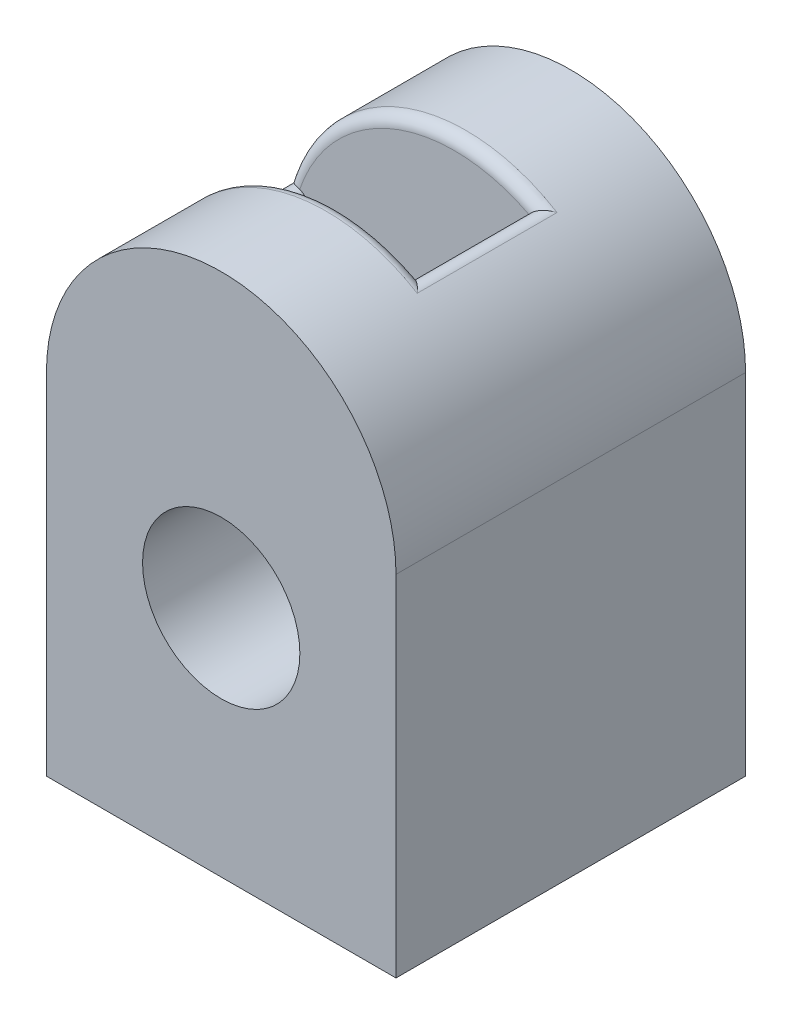
ISO-10303-21;
HEADER;
FILE_DESCRIPTION(('STEP AP214'),'2;1');
FILE_NAME('part.step','',(''),(''),'','','');
FILE_SCHEMA(('AUTOMOTIVE_DESIGN { 1 0 10303 214 1 1 1 1 }'));
ENDSEC;
DATA;
#1=APPLICATION_CONTEXT('core data for automotive mechanical design processes');
#2=APPLICATION_PROTOCOL_DEFINITION('international standard','automotive_design',2000,#1);
#3=PRODUCT_CONTEXT('',#1,'mechanical');
#4=PRODUCT('Part','Part','',(#3));
#5=PRODUCT_RELATED_PRODUCT_CATEGORY('part','',(#4));
#6=PRODUCT_DEFINITION_FORMATION('','',#4);
#7=PRODUCT_DEFINITION_CONTEXT('part definition',#1,'design');
#8=PRODUCT_DEFINITION('design','',#6,#7);
#9=PRODUCT_DEFINITION_SHAPE('','',#8);
#10=(LENGTH_UNIT() NAMED_UNIT(*) SI_UNIT(.MILLI.,.METRE.));
#11=(NAMED_UNIT(*) PLANE_ANGLE_UNIT() SI_UNIT($,.RADIAN.));
#12=(NAMED_UNIT(*) SI_UNIT($,.STERADIAN.) SOLID_ANGLE_UNIT());
#13=UNCERTAINTY_MEASURE_WITH_UNIT(LENGTH_MEASURE(1.E-05),#10,'distance_accuracy_value','');
#14=(GEOMETRIC_REPRESENTATION_CONTEXT(3) GLOBAL_UNCERTAINTY_ASSIGNED_CONTEXT((#13)) GLOBAL_UNIT_ASSIGNED_CONTEXT((#10,
#11,#12)) REPRESENTATION_CONTEXT('',''));
#15=CARTESIAN_POINT('',(0.,0.,0.));
#16=DIRECTION('',(0.,0.,1.));
#17=DIRECTION('',(1.,0.,0.));
#18=AXIS2_PLACEMENT_3D('',#15,#16,#17);
#19=CARTESIAN_POINT('',(-13.5522693622497,13.5122635341086,15.));
#20=DIRECTION('',(0.,0.,-1.));
#21=DIRECTION('',(-1.,0.,0.));
#22=AXIS2_PLACEMENT_3D('',#19,#20,#21);
#23=CYLINDRICAL_SURFACE('',#22,1.);
#24=CARTESIAN_POINT('',(-13.2669813282875,14.470705362118,-5.));
#25=CARTESIAN_POINT('',(-13.2886549354625,14.4771599167456,-4.99999697005028));
#26=CARTESIAN_POINT('',(-13.310535261551,14.482868500035,-5.00076675264369));
#27=CARTESIAN_POINT('',(-13.3545139344958,14.4927733665127,-5.00380524962965));
#28=CARTESIAN_POINT('',(-13.3766120810924,14.4969709259286,-5.006072694469));
#29=CARTESIAN_POINT('',(-13.4425790289543,14.5072162741307,-5.01499715030661));
#30=CARTESIAN_POINT('',(-13.4865354315754,14.5110386782043,-5.02377821691352));
#31=CARTESIAN_POINT('',(-13.5730866238791,14.5129839438399,-5.04626487565494));
#32=CARTESIAN_POINT('',(-13.615685124967,14.511123984371,-5.05995551457227));
#33=CARTESIAN_POINT('',(-13.6988671923582,14.5023460961429,-5.09143053413603));
#34=CARTESIAN_POINT('',(-13.7394458016846,14.495416321907,-5.10922443514525));
#35=CARTESIAN_POINT('',(-13.8338845789855,14.4734619662784,-5.15596338401785));
#36=CARTESIAN_POINT('',(-13.8864557144665,14.4562941085068,-5.18650397289579));
#37=CARTESIAN_POINT('',(-13.9856768012027,14.4150680381352,-5.252169021299));
#38=CARTESIAN_POINT('',(-14.0323161855177,14.3909977709159,-5.28730144123304));
#39=CARTESIAN_POINT('',(-14.1350318671314,14.3278634579868,-5.37387849632621));
#40=CARTESIAN_POINT('',(-14.1885560859107,14.2865122624385,-5.42667747027591));
#41=CARTESIAN_POINT('',(-14.2845377521119,14.1964581262902,-5.5358934012387));
#42=CARTESIAN_POINT('',(-14.3269807320591,14.1477457046304,-5.59231496936035));
#43=CARTESIAN_POINT('',(-14.4003008040791,14.0458438914801,-5.70614712182948));
#44=CARTESIAN_POINT('',(-14.4313782085426,13.9927545426096,-5.76351983091358));
#45=CARTESIAN_POINT('',(-14.4830777865351,13.8827716485123,-5.87909931601603));
#46=CARTESIAN_POINT('',(-14.5037226968683,13.8258866847549,-5.93730399143005));
#47=CARTESIAN_POINT('',(-14.5194975786207,13.766176973755,-5.99696764936091));
#48=CARTESIAN_POINT('',(-14.5198948833203,13.7646586760216,-5.99848384889321));
#49=CARTESIAN_POINT('',(-14.5202886024104,13.7631395008306,-6.));
#50=B_SPLINE_CURVE_WITH_KNOTS('',3,(#24,#25,#26,#27,#28,#29,#30,#31,#32,#33,#34,#35,#36,#37,#38,
#39,#40,#41,#42,#43,#44,#45,#46,#47,#48,#49),.UNSPECIFIED.,.F.,.F.,(4,2,2,2,2,2,2,2,2,2,2,2,4),
(0.,0.0677892638747012,0.135521137096123,0.269707441452711,0.403488474507335,0.537583085428256,
0.726069137009203,0.914886393459821,1.17092839575811,1.42730302910178,1.67891241974008,
1.92997105648405,1.93651760257399),.UNSPECIFIED.);
#51=CARTESIAN_POINT('',(-14.5202886024104,13.7631395008306,-6.));
#52=VERTEX_POINT('',#51);
#53=CARTESIAN_POINT('',(-13.2669813282875,14.470705362118,-5.));
#54=VERTEX_POINT('',#53);
#55=EDGE_CURVE('E11',#52,#54,#50,.F.);
#56=ORIENTED_EDGE('',*,*,#55,.F.);
#57=DIRECTION('',(0.,0.,-1.));
#58=VECTOR('',#57,1.);
#59=CARTESIAN_POINT('',(-14.5202886024104,13.7631395008306,15.));
#60=LINE('',#59,#58);
#61=CARTESIAN_POINT('',(-14.5202886024104,13.7631395008306,6.));
#62=VERTEX_POINT('',#61);
#63=EDGE_CURVE('E241',#62,#52,#60,.T.);
#64=ORIENTED_EDGE('',*,*,#63,.F.);
#65=CARTESIAN_POINT('',(-13.2669813282875,14.470705362118,5.));
#66=CARTESIAN_POINT('',(-13.2886549354625,14.4771599167456,4.99999697005028));
#67=CARTESIAN_POINT('',(-13.310535261551,14.482868500035,5.00076675264369));
#68=CARTESIAN_POINT('',(-13.3545139344958,14.4927733665127,5.00380524962965));
#69=CARTESIAN_POINT('',(-13.3766120810924,14.4969709259286,5.006072694469));
#70=CARTESIAN_POINT('',(-13.4425790289543,14.5072162741307,5.01499715030661));
#71=CARTESIAN_POINT('',(-13.4865354315754,14.5110386782043,5.02377821691352));
#72=CARTESIAN_POINT('',(-13.5730866238791,14.5129839438399,5.04626487565494));
#73=CARTESIAN_POINT('',(-13.615685124967,14.511123984371,5.05995551457227));
#74=CARTESIAN_POINT('',(-13.6988671923582,14.5023460961429,5.09143053413603));
#75=CARTESIAN_POINT('',(-13.7394458016846,14.495416321907,5.10922443514525));
#76=CARTESIAN_POINT('',(-13.8338845789855,14.4734619662784,5.15596338401785));
#77=CARTESIAN_POINT('',(-13.8864557144665,14.4562941085068,5.18650397289579));
#78=CARTESIAN_POINT('',(-13.9856768012027,14.4150680381352,5.252169021299));
#79=CARTESIAN_POINT('',(-14.0323161855177,14.3909977709159,5.28730144123304));
#80=CARTESIAN_POINT('',(-14.1350318671314,14.3278634579868,5.37387849632621));
#81=CARTESIAN_POINT('',(-14.1885560859107,14.2865122624385,5.42667747027592));
#82=CARTESIAN_POINT('',(-14.2845377521119,14.1964581262902,5.5358934012387));
#83=CARTESIAN_POINT('',(-14.3269807320591,14.1477457046304,5.59231496936035));
#84=CARTESIAN_POINT('',(-14.4003008040791,14.0458438914801,5.70614712182949));
#85=CARTESIAN_POINT('',(-14.4313782085426,13.9927545426096,5.76351983091359));
#86=CARTESIAN_POINT('',(-14.4830777865351,13.8827716485123,5.87909931601603));
#87=CARTESIAN_POINT('',(-14.5037226968683,13.8258866847549,5.93730399143005));
#88=CARTESIAN_POINT('',(-14.5194975786207,13.766176973755,5.99696764936091));
#89=CARTESIAN_POINT('',(-14.5198948833203,13.7646586760216,5.99848384889321));
#90=CARTESIAN_POINT('',(-14.5202886024104,13.7631395008306,6.));
#91=B_SPLINE_CURVE_WITH_KNOTS('',3,(#65,#66,#67,#68,#69,#70,#71,#72,#73,#74,#75,#76,#77,#78,#79,
#80,#81,#82,#83,#84,#85,#86,#87,#88,#89,#90),.UNSPECIFIED.,.F.,.F.,(4,2,2,2,2,2,2,2,2,2,2,2,4),
(0.,0.0677892638747012,0.135521137096123,0.269707441452711,0.403488474507335,0.537583085428256,
0.726069137009202,0.914886393459821,1.17092839575811,1.42730302910177,1.67891241974008,
1.92997105648405,1.93651760257399),.UNSPECIFIED.);
#92=CARTESIAN_POINT('',(-13.2669813282875,14.470705362118,5.));
#93=VERTEX_POINT('',#92);
#94=EDGE_CURVE('E61',#62,#93,#91,.F.);
#95=ORIENTED_EDGE('',*,*,#94,.T.);
#96=CARTESIAN_POINT('',(-13.5522693622497,13.5122635341086,5.));
#97=DIRECTION('',(0.,0.,1.));
#98=DIRECTION('',(1.,0.,0.));
#99=AXIS2_PLACEMENT_3D('',#96,#97,#98);
#100=CIRCLE('',#99,1.);
#101=CARTESIAN_POINT('',(-12.5674616092375,13.6859117117755,5.));
#102=VERTEX_POINT('',#101);
#103=EDGE_CURVE('E277',#102,#93,#100,.T.);
#104=ORIENTED_EDGE('',*,*,#103,.F.);
#105=DIRECTION('',(0.,0.,1.));
#106=VECTOR('',#105,1.);
#107=CARTESIAN_POINT('',(-12.5674616092375,13.6859117117755,15.));
#108=LINE('',#107,#106);
#109=CARTESIAN_POINT('',(-12.5674616092375,13.6859117117755,-5.));
#110=VERTEX_POINT('',#109);
#111=EDGE_CURVE('E264',#110,#102,#108,.T.);
#112=ORIENTED_EDGE('',*,*,#111,.F.);
#113=CARTESIAN_POINT('',(-13.5522693622497,13.5122635341086,-5.));
#114=DIRECTION('',(0.,0.,1.));
#115=DIRECTION('',(1.,0.,0.));
#116=AXIS2_PLACEMENT_3D('',#113,#114,#115);
#117=CIRCLE('',#116,1.);
#118=EDGE_CURVE('E268',#54,#110,#117,.F.);
#119=ORIENTED_EDGE('',*,*,#118,.F.);
#120=EDGE_LOOP('',(#56,#64,#95,#104,#112,#119));
#121=FACE_BOUND('',#120,.T.);
#122=ADVANCED_FACE('F47',(#121),#23,.T.);
#123=CARTESIAN_POINT('',(0.,10.,6.));
#124=DIRECTION('',(0.,0.,1.));
#125=DIRECTION('',(1.,0.,0.));
#126=AXIS2_PLACEMENT_3D('',#123,#124,#125);
#127=TOROIDAL_SURFACE('',#126,14.,1.);
#128=ORIENTED_EDGE('',*,*,#94,.F.);
#129=CARTESIAN_POINT('',(0.,10.,6.));
#130=DIRECTION('',(0.,0.,1.));
#131=DIRECTION('',(1.,0.,0.));
#132=AXIS2_PLACEMENT_3D('',#129,#130,#131);
#133=CIRCLE('',#132,15.);
#134=CARTESIAN_POINT('',(7.82142623199868,22.7994254440347,6.));
#135=VERTEX_POINT('',#134);
#136=EDGE_CURVE('E245',#135,#62,#133,.T.);
#137=ORIENTED_EDGE('',*,*,#136,.F.);
#138=CARTESIAN_POINT('',(6.42862471042072,22.4367513576725,5.));
#139=CARTESIAN_POINT('',(6.439717062729,22.4564583676863,4.99999697005028));
#140=CARTESIAN_POINT('',(6.45147660296128,22.4757728649988,5.00076675264369));
#141=CARTESIAN_POINT('',(6.47620374113259,22.5134663484116,5.00380524962965));
#142=CARTESIAN_POINT('',(6.48917030789677,22.5318461126757,5.006072694469));
#143=CARTESIAN_POINT('',(6.52946644456382,22.5850704185867,5.01499715030661));
#144=CARTESIAN_POINT('',(6.55840605439916,22.6183762001699,5.02377821691352));
#145=CARTESIAN_POINT('',(6.61926879127697,22.6799442130283,5.04626487565494));
#146=CARTESIAN_POINT('',(6.65118264348203,22.7082213730977,5.05995551457228));
#147=CARTESIAN_POINT('',(6.71707822504064,22.7597391369105,5.09143053413604));
#148=CARTESIAN_POINT('',(6.7510646260829,22.78296777979,5.10922443514526));
#149=CARTESIAN_POINT('',(6.83421197704798,22.8328395595522,5.15596338401785));
#150=CARTESIAN_POINT('',(6.88393632844746,22.8570459327652,5.18650397289579));
#151=CARTESIAN_POINT('',(6.98391886276522,22.8963893663061,5.252169021299));
#152=CARTESIAN_POINT('',(7.03417783019041,22.9115104154312,5.28730144123304));
#153=CARTESIAN_POINT('',(7.15190280122643,22.9375350943527,5.3738784963262));
#154=CARTESIAN_POINT('',(7.21912431827498,22.9450204811101,5.42667747027587));
#155=CARTESIAN_POINT('',(7.35072316746366,22.9470131116227,5.53589340123874));
#156=CARTESIAN_POINT('',(7.41509669119493,22.9415034824901,5.59231496936051));
#157=CARTESIAN_POINT('',(7.53864225567926,22.9192255566297,5.70614712182932));
#158=CARTESIAN_POINT('',(7.59788873693334,22.9026684285349,5.76351983091299));
#159=CARTESIAN_POINT('',(7.71151087643714,22.8595512304243,5.87909931601664));
#160=CARTESIAN_POINT('',(7.76589691267645,22.8330131354223,5.9373039914323));
#161=CARTESIAN_POINT('',(7.81874599782241,22.8010589388046,5.99696764936103));
#162=CARTESIAN_POINT('',(7.82008709862077,22.8002437531323,5.99848384889327));
#163=CARTESIAN_POINT('',(7.82142623199868,22.7994254440347,6.));
#164=B_SPLINE_CURVE_WITH_KNOTS('',3,(#138,#139,#140,#141,#142,#143,#144,#145,#146,#147,#148,
#149,#150,#151,#152,#153,#154,#155,#156,#157,#158,#159,#160,#161,#162,#163),.UNSPECIFIED.,.F.,
.F.,(4,2,2,2,2,2,2,2,2,2,2,2,4),(0.,0.0677892638747008,0.135521137096124,0.269707441452713,
0.403488474507336,0.537583085428258,0.7260691370092,0.914886393459817,1.1709283957581,
1.42730302910177,1.67891241974008,1.92997105648405,1.93651760257399),.UNSPECIFIED.);
#165=CARTESIAN_POINT('',(6.42862471042072,22.4367513576725,5.));
#166=VERTEX_POINT('',#165);
#167=EDGE_CURVE('E289',#135,#166,#164,.F.);
#168=ORIENTED_EDGE('',*,*,#167,.T.);
#169=CARTESIAN_POINT('',(0.,10.,5.));
#170=DIRECTION('',(0.,0.,1.));
#171=DIRECTION('',(1.,0.,0.));
#172=AXIS2_PLACEMENT_3D('',#169,#170,#171);
#173=CIRCLE('',#172,14.);
#174=EDGE_CURVE('E68',#93,#166,#173,.F.);
#175=ORIENTED_EDGE('',*,*,#174,.F.);
#176=EDGE_LOOP('',(#128,#137,#168,#175));
#177=FACE_BOUND('',#176,.T.);
#178=ADVANCED_FACE('F302',(#177),#127,.T.);
#179=CARTESIAN_POINT('',(7.2999978165321,21.9461304144324,15.));
#180=DIRECTION('',(0.,0.,-1.));
#181=DIRECTION('',(-1.,0.,0.));
#182=AXIS2_PLACEMENT_3D('',#179,#180,#181);
#183=CYLINDRICAL_SURFACE('',#182,1.);
#184=ORIENTED_EDGE('',*,*,#167,.F.);
#185=DIRECTION('',(0.,0.,-1.));
#186=VECTOR('',#185,1.);
#187=CARTESIAN_POINT('',(7.82142623199868,22.7994254440347,15.));
#188=LINE('',#187,#186);
#189=CARTESIAN_POINT('',(7.82142623199868,22.7994254440347,-6.));
#190=VERTEX_POINT('',#189);
#191=EDGE_CURVE('E249',#190,#135,#188,.F.);
#192=ORIENTED_EDGE('',*,*,#191,.F.);
#193=CARTESIAN_POINT('',(6.42862471042072,22.4367513576725,-5.));
#194=CARTESIAN_POINT('',(6.439717062729,22.4564583676863,-4.99999697005028));
#195=CARTESIAN_POINT('',(6.45147660296128,22.4757728649988,-5.00076675264369));
#196=CARTESIAN_POINT('',(6.47620374113259,22.5134663484116,-5.00380524962965));
#197=CARTESIAN_POINT('',(6.48917030789677,22.5318461126757,-5.006072694469));
#198=CARTESIAN_POINT('',(6.52946644456381,22.5850704185867,-5.01499715030661));
#199=CARTESIAN_POINT('',(6.55840605439916,22.6183762001699,-5.02377821691352));
#200=CARTESIAN_POINT('',(6.61926879127697,22.6799442130283,-5.04626487565494));
#201=CARTESIAN_POINT('',(6.65118264348203,22.7082213730977,-5.05995551457227));
#202=CARTESIAN_POINT('',(6.71707822504064,22.7597391369105,-5.09143053413603));
#203=CARTESIAN_POINT('',(6.7510646260829,22.78296777979,-5.10922443514526));
#204=CARTESIAN_POINT('',(6.83421197704798,22.8328395595522,-5.15596338401785));
#205=CARTESIAN_POINT('',(6.88393632844746,22.8570459327652,-5.18650397289579));
#206=CARTESIAN_POINT('',(6.98391886276523,22.8963893663061,-5.252169021299));
#207=CARTESIAN_POINT('',(7.03417783019042,22.9115104154311,-5.28730144123303));
#208=CARTESIAN_POINT('',(7.15190280122642,22.9375350943527,-5.37387849632621));
#209=CARTESIAN_POINT('',(7.21912431827493,22.9450204811102,-5.42667747027593));
#210=CARTESIAN_POINT('',(7.3507231674637,22.9470131116227,-5.53589340123869));
#211=CARTESIAN_POINT('',(7.4150966911951,22.94150348249,-5.59231496936031));
#212=CARTESIAN_POINT('',(7.5386422556791,22.9192255566298,-5.70614712182952));
#213=CARTESIAN_POINT('',(7.59788873693273,22.9026684285352,-5.76351983091372));
#214=CARTESIAN_POINT('',(7.71151087643775,22.859551230424,-5.87909931601591));
#215=CARTESIAN_POINT('',(7.76589691267872,22.8330131354209,-5.93730399142958));
#216=CARTESIAN_POINT('',(7.81874599782253,22.8010589388046,-5.99696764936089));
#217=CARTESIAN_POINT('',(7.82008709862083,22.8002437531323,-5.9984838488932));
#218=CARTESIAN_POINT('',(7.82142623199868,22.7994254440347,-6.));
#219=B_SPLINE_CURVE_WITH_KNOTS('',3,(#193,#194,#195,#196,#197,#198,#199,#200,#201,#202,#203,
#204,#205,#206,#207,#208,#209,#210,#211,#212,#213,#214,#215,#216,#217,#218),.UNSPECIFIED.,.F.,
.F.,(4,2,2,2,2,2,2,2,2,2,2,2,4),(0.,0.0677892638747004,0.13552113709612,0.269707441452713,
0.403488474507337,0.537583085428258,0.726069137009199,0.914886393459817,1.17092839575811,
1.42730302910177,1.67891241974008,1.92997105648405,1.93651760257399),.UNSPECIFIED.);
#220=CARTESIAN_POINT('',(6.42862471042072,22.4367513576725,-5.));
#221=VERTEX_POINT('',#220);
#222=EDGE_CURVE('E280',#190,#221,#219,.F.);
#223=ORIENTED_EDGE('',*,*,#222,.T.);
#224=CARTESIAN_POINT('',(7.2999978165321,21.9461304144324,-5.));
#225=DIRECTION('',(0.,0.,1.));
#226=DIRECTION('',(1.,0.,0.));
#227=AXIS2_PLACEMENT_3D('',#224,#225,#226);
#228=CIRCLE('',#227,1.);
#229=CARTESIAN_POINT('',(6.3151900635199,21.7724822367655,-5.));
#230=VERTEX_POINT('',#229);
#231=EDGE_CURVE('E271',#230,#221,#228,.F.);
#232=ORIENTED_EDGE('',*,*,#231,.F.);
#233=DIRECTION('',(0.,0.,1.));
#234=VECTOR('',#233,1.);
#235=CARTESIAN_POINT('',(6.3151900635199,21.7724822367655,15.));
#236=LINE('',#235,#234);
#237=CARTESIAN_POINT('',(6.3151900635199,21.7724822367655,5.));
#238=VERTEX_POINT('',#237);
#239=EDGE_CURVE('E160',#238,#230,#236,.F.);
#240=ORIENTED_EDGE('',*,*,#239,.F.);
#241=CARTESIAN_POINT('',(7.2999978165321,21.9461304144324,5.));
#242=DIRECTION('',(0.,0.,1.));
#243=DIRECTION('',(1.,0.,0.));
#244=AXIS2_PLACEMENT_3D('',#241,#242,#243);
#245=CIRCLE('',#244,1.);
#246=EDGE_CURVE('E274',#166,#238,#245,.T.);
#247=ORIENTED_EDGE('',*,*,#246,.F.);
#248=EDGE_LOOP('',(#184,#192,#223,#232,#240,#247));
#249=FACE_BOUND('',#248,.T.);
#250=ADVANCED_FACE('F294',(#249),#183,.T.);
#251=CARTESIAN_POINT('',(0.,10.,-6.));
#252=DIRECTION('',(0.,0.,1.));
#253=DIRECTION('',(1.,0.,0.));
#254=AXIS2_PLACEMENT_3D('',#251,#252,#253);
#255=TOROIDAL_SURFACE('',#254,14.,1.);
#256=CARTESIAN_POINT('',(0.,10.,-6.));
#257=DIRECTION('',(0.,0.,1.));
#258=DIRECTION('',(1.,0.,0.));
#259=AXIS2_PLACEMENT_3D('',#256,#257,#258);
#260=CIRCLE('',#259,15.);
#261=EDGE_CURVE('E253',#52,#190,#260,.F.);
#262=ORIENTED_EDGE('',*,*,#261,.F.);
#263=ORIENTED_EDGE('',*,*,#55,.T.);
#264=CARTESIAN_POINT('',(0.,10.,-5.));
#265=DIRECTION('',(0.,0.,1.));
#266=DIRECTION('',(1.,0.,0.));
#267=AXIS2_PLACEMENT_3D('',#264,#265,#266);
#268=CIRCLE('',#267,14.);
#269=EDGE_CURVE('E257',#221,#54,#268,.T.);
#270=ORIENTED_EDGE('',*,*,#269,.F.);
#271=ORIENTED_EDGE('',*,*,#222,.F.);
#272=EDGE_LOOP('',(#262,#263,#270,#271));
#273=FACE_BOUND('',#272,.T.);
#274=ADVANCED_FACE('F297',(#273),#255,.T.);
#275=CARTESIAN_POINT('',(0.,10.,15.));
#276=DIRECTION('',(0.,0.,-1.));
#277=DIRECTION('',(-1.,0.,0.));
#278=AXIS2_PLACEMENT_3D('',#275,#276,#277);
#279=CYLINDRICAL_SURFACE('',#278,15.);
#280=ORIENTED_EDGE('',*,*,#63,.T.);
#281=ORIENTED_EDGE('',*,*,#261,.T.);
#282=ORIENTED_EDGE('',*,*,#191,.T.);
#283=ORIENTED_EDGE('',*,*,#136,.T.);
#284=EDGE_LOOP('',(#280,#281,#282,#283));
#285=FACE_BOUND('',#284,.T.);
#286=CARTESIAN_POINT('',(0.,10.,-15.));
#287=DIRECTION('',(0.,0.,1.));
#288=DIRECTION('',(1.,0.,0.));
#289=AXIS2_PLACEMENT_3D('',#286,#287,#288);
#290=CIRCLE('',#289,15.);
#291=CARTESIAN_POINT('',(-15.,10.,-15.));
#292=VERTEX_POINT('',#291);
#293=CARTESIAN_POINT('',(15.,10.,-15.));
#294=VERTEX_POINT('',#293);
#295=EDGE_CURVE('E215',#292,#294,#290,.F.);
#296=ORIENTED_EDGE('',*,*,#295,.F.);
#297=DIRECTION('',(0.,0.,-1.));
#298=VECTOR('',#297,1.);
#299=CARTESIAN_POINT('',(-15.,10.,15.));
#300=LINE('',#299,#298);
#301=CARTESIAN_POINT('',(-15.,10.,15.));
#302=VERTEX_POINT('',#301);
#303=EDGE_CURVE('E235',#302,#292,#300,.T.);
#304=ORIENTED_EDGE('',*,*,#303,.F.);
#305=CARTESIAN_POINT('',(0.,10.,15.));
#306=DIRECTION('',(0.,0.,1.));
#307=DIRECTION('',(1.,0.,0.));
#308=AXIS2_PLACEMENT_3D('',#305,#306,#307);
#309=CIRCLE('',#308,15.);
#310=CARTESIAN_POINT('',(15.,10.,15.));
#311=VERTEX_POINT('',#310);
#312=EDGE_CURVE('E195',#302,#311,#309,.F.);
#313=ORIENTED_EDGE('',*,*,#312,.T.);
#314=DIRECTION('',(0.,0.,-1.));
#315=VECTOR('',#314,1.);
#316=CARTESIAN_POINT('',(15.,10.,15.));
#317=LINE('',#316,#315);
#318=EDGE_CURVE('E238',#311,#294,#317,.T.);
#319=ORIENTED_EDGE('',*,*,#318,.T.);
#320=EDGE_LOOP('',(#296,#304,#313,#319));
#321=FACE_BOUND('',#320,.T.);
#322=ADVANCED_FACE('F300',(#285,#321),#279,.T.);
#323=CARTESIAN_POINT('',(0.,0.,15.));
#324=DIRECTION('',(0.,0.,-1.));
#325=DIRECTION('',(-1.,0.,0.));
#326=AXIS2_PLACEMENT_3D('',#323,#324,#325);
#327=CYLINDRICAL_SURFACE('',#326,6.75);
#328=CARTESIAN_POINT('',(0.,0.,-15.));
#329=DIRECTION('',(0.,0.,1.));
#330=DIRECTION('',(1.,0.,0.));
#331=AXIS2_PLACEMENT_3D('',#328,#329,#330);
#332=CIRCLE('',#331,6.75);
#333=CARTESIAN_POINT('',(6.75,0.,-15.));
#334=VERTEX_POINT('',#333);
#335=EDGE_CURVE('E196',#334,#334,#332,.T.);
#336=ORIENTED_EDGE('',*,*,#335,.F.);
#337=EDGE_LOOP('',(#336));
#338=FACE_BOUND('',#337,.T.);
#339=CARTESIAN_POINT('',(0.,0.,-5.));
#340=DIRECTION('',(0.,0.,1.));
#341=DIRECTION('',(1.,0.,0.));
#342=AXIS2_PLACEMENT_3D('',#339,#340,#341);
#343=CIRCLE('',#342,6.75);
#344=CARTESIAN_POINT('',(6.75,0.,-5.));
#345=VERTEX_POINT('',#344);
#346=EDGE_CURVE('E169',#345,#345,#343,.T.);
#347=ORIENTED_EDGE('',*,*,#346,.T.);
#348=EDGE_LOOP('',(#347));
#349=FACE_BOUND('',#348,.T.);
#350=ADVANCED_FACE('F329',(#338,#349),#327,.F.);
#351=CARTESIAN_POINT('',(15.,0.,15.));
#352=DIRECTION('',(-1.,0.,0.));
#353=DIRECTION('',(0.,0.,1.));
#354=AXIS2_PLACEMENT_3D('',#351,#352,#353);
#355=PLANE('',#354);
#356=DIRECTION('',(0.,1.,0.));
#357=VECTOR('',#356,1.);
#358=CARTESIAN_POINT('',(15.,0.,-15.));
#359=LINE('',#358,#357);
#360=CARTESIAN_POINT('',(15.,-20.,-15.));
#361=VERTEX_POINT('',#360);
#362=EDGE_CURVE('E190',#361,#294,#359,.T.);
#363=ORIENTED_EDGE('',*,*,#362,.T.);
#364=ORIENTED_EDGE('',*,*,#318,.F.);
#365=DIRECTION('',(0.,1.,0.));
#366=VECTOR('',#365,1.);
#367=CARTESIAN_POINT('',(15.,0.,15.));
#368=LINE('',#367,#366);
#369=CARTESIAN_POINT('',(15.,-20.,15.));
#370=VERTEX_POINT('',#369);
#371=EDGE_CURVE('E192',#370,#311,#368,.T.);
#372=ORIENTED_EDGE('',*,*,#371,.F.);
#373=DIRECTION('',(0.,0.,-1.));
#374=VECTOR('',#373,1.);
#375=CARTESIAN_POINT('',(15.,-20.,15.));
#376=LINE('',#375,#374);
#377=EDGE_CURVE('E211',#370,#361,#376,.T.);
#378=ORIENTED_EDGE('',*,*,#377,.T.);
#379=EDGE_LOOP('',(#363,#364,#372,#378));
#380=FACE_BOUND('',#379,.T.);
#381=ADVANCED_FACE('F350',(#380),#355,.F.);
#382=CARTESIAN_POINT('',(-15.,0.,15.));
#383=DIRECTION('',(-1.,0.,0.));
#384=DIRECTION('',(0.,0.,1.));
#385=AXIS2_PLACEMENT_3D('',#382,#383,#384);
#386=PLANE('',#385);
#387=DIRECTION('',(0.,1.,0.));
#388=VECTOR('',#387,1.);
#389=CARTESIAN_POINT('',(-15.,0.,-15.));
#390=LINE('',#389,#388);
#391=CARTESIAN_POINT('',(-15.,-20.,-15.));
#392=VERTEX_POINT('',#391);
#393=EDGE_CURVE('E219',#392,#292,#390,.T.);
#394=ORIENTED_EDGE('',*,*,#393,.F.);
#395=DIRECTION('',(0.,0.,-1.));
#396=VECTOR('',#395,1.);
#397=CARTESIAN_POINT('',(-15.,-20.,15.));
#398=LINE('',#397,#396);
#399=CARTESIAN_POINT('',(-15.,-20.,15.));
#400=VERTEX_POINT('',#399);
#401=EDGE_CURVE('E232',#400,#392,#398,.T.);
#402=ORIENTED_EDGE('',*,*,#401,.F.);
#403=DIRECTION('',(0.,1.,0.));
#404=VECTOR('',#403,1.);
#405=CARTESIAN_POINT('',(-15.,0.,15.));
#406=LINE('',#405,#404);
#407=EDGE_CURVE('E200',#400,#302,#406,.T.);
#408=ORIENTED_EDGE('',*,*,#407,.T.);
#409=ORIENTED_EDGE('',*,*,#303,.T.);
#410=EDGE_LOOP('',(#394,#402,#408,#409));
#411=FACE_BOUND('',#410,.T.);
#412=ADVANCED_FACE('F341',(#411),#386,.T.);
#413=CARTESIAN_POINT('',(0.,-20.,15.));
#414=DIRECTION('',(0.,1.,0.));
#415=DIRECTION('',(0.,0.,1.));
#416=AXIS2_PLACEMENT_3D('',#413,#414,#415);
#417=PLANE('',#416);
#418=DIRECTION('',(1.,0.,0.));
#419=VECTOR('',#418,1.);
#420=CARTESIAN_POINT('',(0.,-20.,-15.));
#421=LINE('',#420,#419);
#422=EDGE_CURVE('E223',#392,#361,#421,.T.);
#423=ORIENTED_EDGE('',*,*,#422,.T.);
#424=ORIENTED_EDGE('',*,*,#377,.F.);
#425=DIRECTION('',(1.,0.,0.));
#426=VECTOR('',#425,1.);
#427=CARTESIAN_POINT('',(0.,-20.,15.));
#428=LINE('',#427,#426);
#429=EDGE_CURVE('E204',#400,#370,#428,.T.);
#430=ORIENTED_EDGE('',*,*,#429,.F.);
#431=ORIENTED_EDGE('',*,*,#401,.T.);
#432=EDGE_LOOP('',(#423,#424,#430,#431));
#433=FACE_BOUND('',#432,.T.);
#434=ADVANCED_FACE('F352',(#433),#417,.F.);
#435=CARTESIAN_POINT('',(0.,0.,5.));
#436=DIRECTION('',(0.,0.,1.));
#437=DIRECTION('',(1.,0.,0.));
#438=AXIS2_PLACEMENT_3D('',#435,#436,#437);
#439=CIRCLE('',#438,6.75);
#440=CARTESIAN_POINT('',(6.75,0.,5.));
#441=VERTEX_POINT('',#440);
#442=EDGE_CURVE('E178',#441,#441,#439,.T.);
#443=ORIENTED_EDGE('',*,*,#442,.F.);
#444=EDGE_LOOP('',(#443));
#445=FACE_BOUND('',#444,.T.);
#446=CARTESIAN_POINT('',(0.,0.,15.));
#447=DIRECTION('',(0.,0.,1.));
#448=DIRECTION('',(1.,0.,0.));
#449=AXIS2_PLACEMENT_3D('',#446,#447,#448);
#450=CIRCLE('',#449,6.75);
#451=CARTESIAN_POINT('',(6.75,0.,15.));
#452=VERTEX_POINT('',#451);
#453=EDGE_CURVE('E207',#452,#452,#450,.T.);
#454=ORIENTED_EDGE('',*,*,#453,.T.);
#455=EDGE_LOOP('',(#454));
#456=FACE_BOUND('',#455,.T.);
#457=ADVANCED_FACE('F354',(#445,#456),#327,.F.);
#458=CARTESIAN_POINT('',(0.,0.,15.));
#459=DIRECTION('',(0.,0.,1.));
#460=DIRECTION('',(1.,0.,0.));
#461=AXIS2_PLACEMENT_3D('',#458,#459,#460);
#462=PLANE('',#461);
#463=ORIENTED_EDGE('',*,*,#371,.T.);
#464=ORIENTED_EDGE('',*,*,#312,.F.);
#465=ORIENTED_EDGE('',*,*,#407,.F.);
#466=ORIENTED_EDGE('',*,*,#429,.T.);
#467=EDGE_LOOP('',(#463,#464,#465,#466));
#468=FACE_BOUND('',#467,.T.);
#469=ORIENTED_EDGE('',*,*,#453,.F.);
#470=EDGE_LOOP('',(#469));
#471=FACE_BOUND('',#470,.T.);
#472=ADVANCED_FACE('F345',(#468,#471),#462,.T.);
#473=CARTESIAN_POINT('',(0.,0.,-15.));
#474=DIRECTION('',(0.,0.,1.));
#475=DIRECTION('',(1.,0.,0.));
#476=AXIS2_PLACEMENT_3D('',#473,#474,#475);
#477=PLANE('',#476);
#478=ORIENTED_EDGE('',*,*,#362,.F.);
#479=ORIENTED_EDGE('',*,*,#422,.F.);
#480=ORIENTED_EDGE('',*,*,#393,.T.);
#481=ORIENTED_EDGE('',*,*,#295,.T.);
#482=EDGE_LOOP('',(#478,#479,#480,#481));
#483=FACE_BOUND('',#482,.T.);
#484=ORIENTED_EDGE('',*,*,#335,.T.);
#485=EDGE_LOOP('',(#484));
#486=FACE_BOUND('',#485,.T.);
#487=ADVANCED_FACE('F338',(#483,#486),#477,.F.);
#488=CARTESIAN_POINT('',(0.,0.,-5.));
#489=DIRECTION('',(0.,0.,1.));
#490=DIRECTION('',(1.,0.,0.));
#491=AXIS2_PLACEMENT_3D('',#488,#489,#490);
#492=CYLINDRICAL_SURFACE('',#491,10.);
#493=CARTESIAN_POINT('',(0.,0.,5.));
#494=DIRECTION('',(0.,0.,1.));
#495=DIRECTION('',(1.,0.,0.));
#496=AXIS2_PLACEMENT_3D('',#493,#494,#495);
#497=CIRCLE('',#496,10.);
#498=CARTESIAN_POINT('',(-9.84807753012208,-1.73648177666931,5.));
#499=VERTEX_POINT('',#498);
#500=CARTESIAN_POINT('',(9.84807753012208,1.73648177666932,5.));
#501=VERTEX_POINT('',#500);
#502=EDGE_CURVE('E147',#499,#501,#497,.T.);
#503=ORIENTED_EDGE('',*,*,#502,.T.);
#504=DIRECTION('',(0.,0.,1.));
#505=VECTOR('',#504,1.);
#506=CARTESIAN_POINT('',(9.84807753012208,1.73648177666932,-5.));
#507=LINE('',#506,#505);
#508=CARTESIAN_POINT('',(9.84807753012208,1.73648177666932,-5.));
#509=VERTEX_POINT('',#508);
#510=EDGE_CURVE('E140',#509,#501,#507,.T.);
#511=ORIENTED_EDGE('',*,*,#510,.F.);
#512=CARTESIAN_POINT('',(0.,0.,-5.));
#513=DIRECTION('',(0.,0.,1.));
#514=DIRECTION('',(1.,0.,0.));
#515=AXIS2_PLACEMENT_3D('',#512,#513,#514);
#516=CIRCLE('',#515,10.);
#517=CARTESIAN_POINT('',(-9.84807753012208,-1.73648177666931,-5.));
#518=VERTEX_POINT('',#517);
#519=EDGE_CURVE('E145',#518,#509,#516,.T.);
#520=ORIENTED_EDGE('',*,*,#519,.F.);
#521=DIRECTION('',(0.,0.,1.));
#522=VECTOR('',#521,1.);
#523=CARTESIAN_POINT('',(-9.84807753012208,-1.73648177666931,-5.));
#524=LINE('',#523,#522);
#525=EDGE_CURVE('E152',#518,#499,#524,.T.);
#526=ORIENTED_EDGE('',*,*,#525,.T.);
#527=EDGE_LOOP('',(#503,#511,#520,#526));
#528=FACE_BOUND('',#527,.T.);
#529=ADVANCED_FACE('F142',(#528),#492,.F.);
#530=CARTESIAN_POINT('',(-9.84807753012208,-1.73648177666932,-5.));
#531=DIRECTION('',(-0.984807753012208,-0.173648177666931,0.));
#532=DIRECTION('',(0.173648177666931,-0.984807753012208,0.));
#533=AXIS2_PLACEMENT_3D('',#530,#531,#532);
#534=PLANE('',#533);
#535=DIRECTION('',(0.173648177666931,-0.984807753012208,0.));
#536=VECTOR('',#535,1.);
#537=CARTESIAN_POINT('',(-9.84807753012208,-1.73648177666932,-5.));
#538=LINE('',#537,#536);
#539=EDGE_CURVE('E153',#110,#518,#538,.T.);
#540=ORIENTED_EDGE('',*,*,#539,.F.);
#541=ORIENTED_EDGE('',*,*,#111,.T.);
#542=DIRECTION('',(0.173648177666931,-0.984807753012208,0.));
#543=VECTOR('',#542,1.);
#544=CARTESIAN_POINT('',(-9.84807753012208,-1.73648177666932,5.));
#545=LINE('',#544,#543);
#546=EDGE_CURVE('E173',#102,#499,#545,.T.);
#547=ORIENTED_EDGE('',*,*,#546,.T.);
#548=ORIENTED_EDGE('',*,*,#525,.F.);
#549=EDGE_LOOP('',(#540,#541,#547,#548));
#550=FACE_BOUND('',#549,.T.);
#551=ADVANCED_FACE('F322',(#550),#534,.F.);
#552=CARTESIAN_POINT('',(9.84807753012209,1.73648177666932,-5.));
#553=DIRECTION('',(0.984807753012208,0.173648177666931,0.));
#554=DIRECTION('',(-0.173648177666931,0.984807753012208,0.));
#555=AXIS2_PLACEMENT_3D('',#552,#553,#554);
#556=PLANE('',#555);
#557=DIRECTION('',(-0.173648177666931,0.984807753012208,0.));
#558=VECTOR('',#557,1.);
#559=CARTESIAN_POINT('',(9.84807753012209,1.73648177666932,5.));
#560=LINE('',#559,#558);
#561=EDGE_CURVE('E184',#501,#238,#560,.T.);
#562=ORIENTED_EDGE('',*,*,#561,.T.);
#563=ORIENTED_EDGE('',*,*,#239,.T.);
#564=DIRECTION('',(-0.173648177666931,0.984807753012208,0.));
#565=VECTOR('',#564,1.);
#566=CARTESIAN_POINT('',(9.84807753012209,1.73648177666932,-5.));
#567=LINE('',#566,#565);
#568=EDGE_CURVE('E157',#509,#230,#567,.T.);
#569=ORIENTED_EDGE('',*,*,#568,.F.);
#570=ORIENTED_EDGE('',*,*,#510,.T.);
#571=EDGE_LOOP('',(#562,#563,#569,#570));
#572=FACE_BOUND('',#571,.T.);
#573=ADVANCED_FACE('F158',(#572),#556,.F.);
#574=CARTESIAN_POINT('',(0.,0.,-5.));
#575=DIRECTION('',(0.,0.,1.));
#576=DIRECTION('',(1.,0.,0.));
#577=AXIS2_PLACEMENT_3D('',#574,#575,#576);
#578=PLANE('',#577);
#579=ORIENTED_EDGE('',*,*,#346,.F.);
#580=EDGE_LOOP('',(#579));
#581=FACE_BOUND('',#580,.T.);
#582=ORIENTED_EDGE('',*,*,#568,.T.);
#583=ORIENTED_EDGE('',*,*,#231,.T.);
#584=ORIENTED_EDGE('',*,*,#269,.T.);
#585=ORIENTED_EDGE('',*,*,#118,.T.);
#586=ORIENTED_EDGE('',*,*,#539,.T.);
#587=ORIENTED_EDGE('',*,*,#519,.T.);
#588=EDGE_LOOP('',(#582,#583,#584,#585,#586,#587));
#589=FACE_BOUND('',#588,.T.);
#590=ADVANCED_FACE('F165',(#581,#589),#578,.T.);
#591=CARTESIAN_POINT('',(0.,0.,5.));
#592=DIRECTION('',(0.,0.,1.));
#593=DIRECTION('',(1.,0.,0.));
#594=AXIS2_PLACEMENT_3D('',#591,#592,#593);
#595=PLANE('',#594);
#596=ORIENTED_EDGE('',*,*,#442,.T.);
#597=EDGE_LOOP('',(#596));
#598=FACE_BOUND('',#597,.T.);
#599=ORIENTED_EDGE('',*,*,#546,.F.);
#600=ORIENTED_EDGE('',*,*,#103,.T.);
#601=ORIENTED_EDGE('',*,*,#174,.T.);
#602=ORIENTED_EDGE('',*,*,#246,.T.);
#603=ORIENTED_EDGE('',*,*,#561,.F.);
#604=ORIENTED_EDGE('',*,*,#502,.F.);
#605=EDGE_LOOP('',(#599,#600,#601,#602,#603,#604));
#606=FACE_BOUND('',#605,.T.);
#607=ADVANCED_FACE('F320',(#598,#606),#595,.F.);
#608=CLOSED_SHELL('',(#122,#178,#250,#274,#322,#350,#381,#412,#434,#457,#472,#487,#529,#551,
#573,#590,#607));
#609=MANIFOLD_SOLID_BREP('B2',#608);
#610=ADVANCED_BREP_SHAPE_REPRESENTATION('',(#18,#609),#14);
#611=SHAPE_DEFINITION_REPRESENTATION(#9,#610);
ENDSEC;
END-ISO-10303-21;
